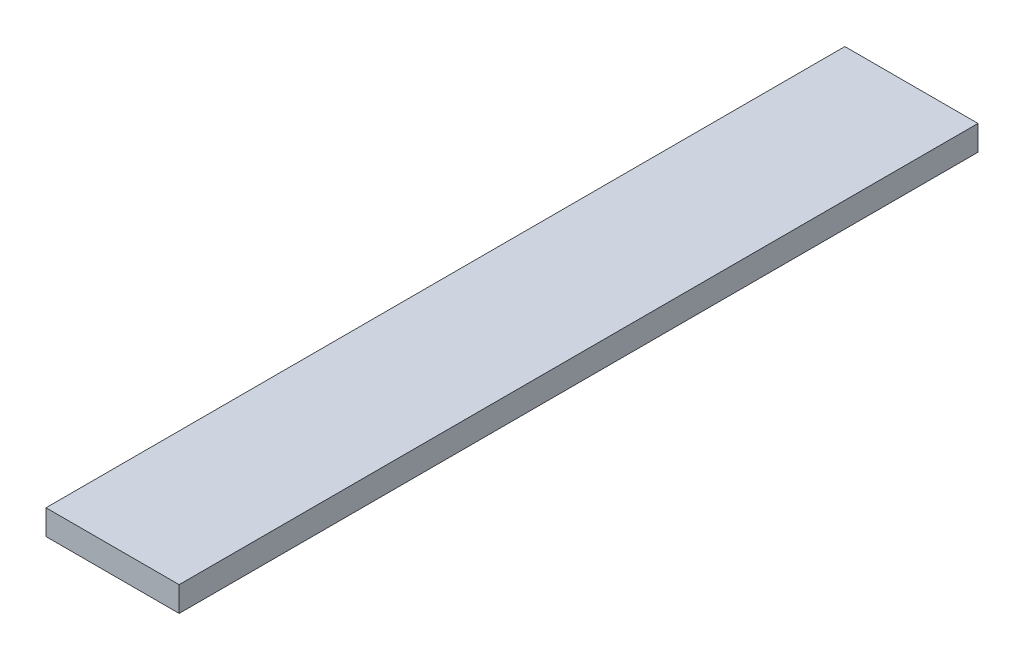
ISO-10303-21;
HEADER;
FILE_DESCRIPTION(('STEP AP214'),'2;1');
FILE_NAME('part.step','',(''),(''),'','','');
FILE_SCHEMA(('AUTOMOTIVE_DESIGN { 1 0 10303 214 1 1 1 1 }'));
ENDSEC;
DATA;
#1=APPLICATION_CONTEXT('core data for automotive mechanical design processes');
#2=APPLICATION_PROTOCOL_DEFINITION('international standard','automotive_design',2000,#1);
#3=PRODUCT_CONTEXT('',#1,'mechanical');
#4=PRODUCT('Part','Part','',(#3));
#5=PRODUCT_RELATED_PRODUCT_CATEGORY('part','',(#4));
#6=PRODUCT_DEFINITION_FORMATION('','',#4);
#7=PRODUCT_DEFINITION_CONTEXT('part definition',#1,'design');
#8=PRODUCT_DEFINITION('design','',#6,#7);
#9=PRODUCT_DEFINITION_SHAPE('','',#8);
#10=(LENGTH_UNIT() NAMED_UNIT(*) SI_UNIT(.MILLI.,.METRE.));
#11=(NAMED_UNIT(*) PLANE_ANGLE_UNIT() SI_UNIT($,.RADIAN.));
#12=(NAMED_UNIT(*) SI_UNIT($,.STERADIAN.) SOLID_ANGLE_UNIT());
#13=UNCERTAINTY_MEASURE_WITH_UNIT(LENGTH_MEASURE(1.E-05),#10,'distance_accuracy_value','');
#14=(GEOMETRIC_REPRESENTATION_CONTEXT(3) GLOBAL_UNCERTAINTY_ASSIGNED_CONTEXT((#13)) GLOBAL_UNIT_ASSIGNED_CONTEXT((#10,
#11,#12)) REPRESENTATION_CONTEXT('',''));
#15=CARTESIAN_POINT('',(0.,0.,0.));
#16=DIRECTION('',(0.,0.,1.));
#17=DIRECTION('',(1.,0.,0.));
#18=AXIS2_PLACEMENT_3D('',#15,#16,#17);
#19=CARTESIAN_POINT('',(50.7999999999999,19.05,-304.8));
#20=DIRECTION('',(-1.,0.,0.));
#21=DIRECTION('',(0.,0.,1.));
#22=AXIS2_PLACEMENT_3D('',#19,#20,#21);
#23=PLANE('',#22);
#24=DIRECTION('',(0.,0.,-1.));
#25=VECTOR('',#24,1.);
#26=CARTESIAN_POINT('',(50.7999999999999,0.,-304.8));
#27=LINE('',#26,#25);
#28=CARTESIAN_POINT('',(50.8,0.,304.8));
#29=VERTEX_POINT('',#28);
#30=CARTESIAN_POINT('',(50.7999999999999,0.,-304.8));
#31=VERTEX_POINT('',#30);
#32=EDGE_CURVE('E95',#29,#31,#27,.T.);
#33=ORIENTED_EDGE('',*,*,#32,.T.);
#34=DIRECTION('',(0.,-1.,0.));
#35=VECTOR('',#34,1.);
#36=CARTESIAN_POINT('',(50.7999999999999,19.05,-304.8));
#37=LINE('',#36,#35);
#38=CARTESIAN_POINT('',(50.7999999999999,19.05,-304.8));
#39=VERTEX_POINT('',#38);
#40=EDGE_CURVE('E11',#39,#31,#37,.T.);
#41=ORIENTED_EDGE('',*,*,#40,.F.);
#42=DIRECTION('',(0.,0.,-1.));
#43=VECTOR('',#42,1.);
#44=CARTESIAN_POINT('',(50.7999999999999,19.05,-304.8));
#45=LINE('',#44,#43);
#46=CARTESIAN_POINT('',(50.8,19.05,304.8));
#47=VERTEX_POINT('',#46);
#48=EDGE_CURVE('E83',#47,#39,#45,.T.);
#49=ORIENTED_EDGE('',*,*,#48,.F.);
#50=DIRECTION('',(0.,-1.,0.));
#51=VECTOR('',#50,1.);
#52=CARTESIAN_POINT('',(50.8,19.05,304.8));
#53=LINE('',#52,#51);
#54=EDGE_CURVE('E91',#47,#29,#53,.T.);
#55=ORIENTED_EDGE('',*,*,#54,.T.);
#56=EDGE_LOOP('',(#33,#41,#49,#55));
#57=FACE_BOUND('',#56,.T.);
#58=ADVANCED_FACE('F32',(#57),#23,.F.);
#59=CARTESIAN_POINT('',(-50.8,19.05,-304.8));
#60=DIRECTION('',(0.,0.,1.));
#61=DIRECTION('',(1.,0.,0.));
#62=AXIS2_PLACEMENT_3D('',#59,#60,#61);
#63=PLANE('',#62);
#64=DIRECTION('',(-1.,0.,0.));
#65=VECTOR('',#64,1.);
#66=CARTESIAN_POINT('',(-50.8,0.,-304.8));
#67=LINE('',#66,#65);
#68=CARTESIAN_POINT('',(-50.8,0.,-304.8));
#69=VERTEX_POINT('',#68);
#70=EDGE_CURVE('E87',#31,#69,#67,.T.);
#71=ORIENTED_EDGE('',*,*,#70,.T.);
#72=DIRECTION('',(0.,-1.,0.));
#73=VECTOR('',#72,1.);
#74=CARTESIAN_POINT('',(-50.8,19.05,-304.8));
#75=LINE('',#74,#73);
#76=CARTESIAN_POINT('',(-50.8,19.05,-304.8));
#77=VERTEX_POINT('',#76);
#78=EDGE_CURVE('E40',#77,#69,#75,.T.);
#79=ORIENTED_EDGE('',*,*,#78,.F.);
#80=DIRECTION('',(-1.,0.,0.));
#81=VECTOR('',#80,1.);
#82=CARTESIAN_POINT('',(-50.8,19.05,-304.8));
#83=LINE('',#82,#81);
#84=EDGE_CURVE('E78',#39,#77,#83,.T.);
#85=ORIENTED_EDGE('',*,*,#84,.F.);
#86=ORIENTED_EDGE('',*,*,#40,.T.);
#87=EDGE_LOOP('',(#71,#79,#85,#86));
#88=FACE_BOUND('',#87,.T.);
#89=ADVANCED_FACE('F86',(#88),#63,.F.);
#90=CARTESIAN_POINT('',(-50.8,19.05,-304.8));
#91=DIRECTION('',(1.,0.,0.));
#92=DIRECTION('',(0.,0.,-1.));
#93=AXIS2_PLACEMENT_3D('',#90,#91,#92);
#94=PLANE('',#93);
#95=DIRECTION('',(0.,0.,1.));
#96=VECTOR('',#95,1.);
#97=CARTESIAN_POINT('',(-50.8,0.,-304.8));
#98=LINE('',#97,#96);
#99=CARTESIAN_POINT('',(-50.8,0.,304.8));
#100=VERTEX_POINT('',#99);
#101=EDGE_CURVE('E65',#69,#100,#98,.T.);
#102=ORIENTED_EDGE('',*,*,#101,.T.);
#103=DIRECTION('',(0.,-1.,0.));
#104=VECTOR('',#103,1.);
#105=CARTESIAN_POINT('',(-50.8,19.05,304.8));
#106=LINE('',#105,#104);
#107=CARTESIAN_POINT('',(-50.8,19.05,304.8));
#108=VERTEX_POINT('',#107);
#109=EDGE_CURVE('E88',#108,#100,#106,.T.);
#110=ORIENTED_EDGE('',*,*,#109,.F.);
#111=DIRECTION('',(0.,0.,1.));
#112=VECTOR('',#111,1.);
#113=CARTESIAN_POINT('',(-50.8,19.05,-304.8));
#114=LINE('',#113,#112);
#115=EDGE_CURVE('E81',#77,#108,#114,.T.);
#116=ORIENTED_EDGE('',*,*,#115,.F.);
#117=ORIENTED_EDGE('',*,*,#78,.T.);
#118=EDGE_LOOP('',(#102,#110,#116,#117));
#119=FACE_BOUND('',#118,.T.);
#120=ADVANCED_FACE('F89',(#119),#94,.F.);
#121=CARTESIAN_POINT('',(-50.8,19.05,304.8));
#122=DIRECTION('',(0.,0.,-1.));
#123=DIRECTION('',(-1.,0.,0.));
#124=AXIS2_PLACEMENT_3D('',#121,#122,#123);
#125=PLANE('',#124);
#126=DIRECTION('',(1.,0.,0.));
#127=VECTOR('',#126,1.);
#128=CARTESIAN_POINT('',(-50.8,0.,304.8));
#129=LINE('',#128,#127);
#130=EDGE_CURVE('E71',#100,#29,#129,.T.);
#131=ORIENTED_EDGE('',*,*,#130,.T.);
#132=ORIENTED_EDGE('',*,*,#54,.F.);
#133=DIRECTION('',(1.,0.,0.));
#134=VECTOR('',#133,1.);
#135=CARTESIAN_POINT('',(-50.8,19.05,304.8));
#136=LINE('',#135,#134);
#137=EDGE_CURVE('E48',#108,#47,#136,.T.);
#138=ORIENTED_EDGE('',*,*,#137,.F.);
#139=ORIENTED_EDGE('',*,*,#109,.T.);
#140=EDGE_LOOP('',(#131,#132,#138,#139));
#141=FACE_BOUND('',#140,.T.);
#142=ADVANCED_FACE('F102',(#141),#125,.F.);
#143=CARTESIAN_POINT('',(50.8,19.05,304.8));
#144=DIRECTION('',(0.,1.,0.));
#145=DIRECTION('',(0.,0.,1.));
#146=AXIS2_PLACEMENT_3D('',#143,#144,#145);
#147=PLANE('',#146);
#148=ORIENTED_EDGE('',*,*,#48,.T.);
#149=ORIENTED_EDGE('',*,*,#84,.T.);
#150=ORIENTED_EDGE('',*,*,#115,.T.);
#151=ORIENTED_EDGE('',*,*,#137,.T.);
#152=EDGE_LOOP('',(#148,#149,#150,#151));
#153=FACE_BOUND('',#152,.T.);
#154=ADVANCED_FACE('F79',(#153),#147,.T.);
#155=CARTESIAN_POINT('',(50.8,0.,304.8));
#156=DIRECTION('',(0.,1.,0.));
#157=DIRECTION('',(0.,0.,1.));
#158=AXIS2_PLACEMENT_3D('',#155,#156,#157);
#159=PLANE('',#158);
#160=ORIENTED_EDGE('',*,*,#32,.F.);
#161=ORIENTED_EDGE('',*,*,#130,.F.);
#162=ORIENTED_EDGE('',*,*,#101,.F.);
#163=ORIENTED_EDGE('',*,*,#70,.F.);
#164=EDGE_LOOP('',(#160,#161,#162,#163));
#165=FACE_BOUND('',#164,.T.);
#166=ADVANCED_FACE('F105',(#165),#159,.F.);
#167=CLOSED_SHELL('',(#58,#89,#120,#142,#154,#166));
#168=MANIFOLD_SOLID_BREP('B2',#167);
#169=ADVANCED_BREP_SHAPE_REPRESENTATION('',(#18,#168),#14);
#170=SHAPE_DEFINITION_REPRESENTATION(#9,#169);
ENDSEC;
END-ISO-10303-21;
